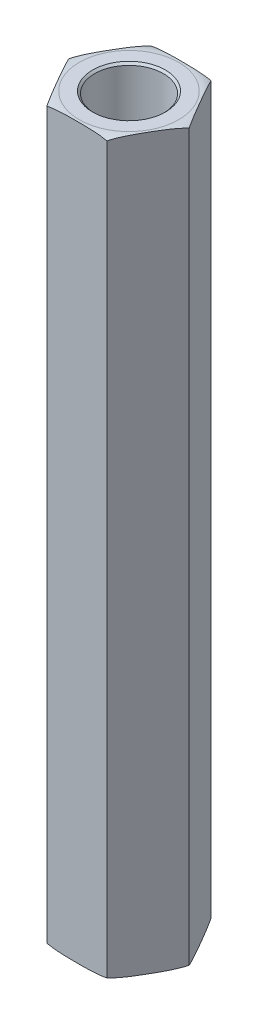
ISO-10303-21;
HEADER;
FILE_DESCRIPTION(('STEP AP214'),'2;1');
FILE_NAME('part.step','',(''),(''),'','','');
FILE_SCHEMA(('AUTOMOTIVE_DESIGN { 1 0 10303 214 1 1 1 1 }'));
ENDSEC;
DATA;
#1=APPLICATION_CONTEXT('core data for automotive mechanical design processes');
#2=APPLICATION_PROTOCOL_DEFINITION('international standard','automotive_design',2000,#1);
#3=PRODUCT_CONTEXT('',#1,'mechanical');
#4=PRODUCT('Part','Part','',(#3));
#5=PRODUCT_RELATED_PRODUCT_CATEGORY('part','',(#4));
#6=PRODUCT_DEFINITION_FORMATION('','',#4);
#7=PRODUCT_DEFINITION_CONTEXT('part definition',#1,'design');
#8=PRODUCT_DEFINITION('design','',#6,#7);
#9=PRODUCT_DEFINITION_SHAPE('','',#8);
#10=(LENGTH_UNIT() NAMED_UNIT(*) SI_UNIT(.MILLI.,.METRE.));
#11=(NAMED_UNIT(*) PLANE_ANGLE_UNIT() SI_UNIT($,.RADIAN.));
#12=(NAMED_UNIT(*) SI_UNIT($,.STERADIAN.) SOLID_ANGLE_UNIT());
#13=UNCERTAINTY_MEASURE_WITH_UNIT(LENGTH_MEASURE(1.E-05),#10,'distance_accuracy_value','');
#14=(GEOMETRIC_REPRESENTATION_CONTEXT(3) GLOBAL_UNCERTAINTY_ASSIGNED_CONTEXT((#13)) GLOBAL_UNIT_ASSIGNED_CONTEXT((#10,
#11,#12)) REPRESENTATION_CONTEXT('',''));
#15=CARTESIAN_POINT('',(0.,0.,0.));
#16=DIRECTION('',(0.,0.,1.));
#17=DIRECTION('',(1.,0.,0.));
#18=AXIS2_PLACEMENT_3D('',#15,#16,#17);
#19=CARTESIAN_POINT('',(0.,9.525,0.));
#20=DIRECTION('',(0.,1.,0.));
#21=DIRECTION('',(0.,0.,1.));
#22=AXIS2_PLACEMENT_3D('',#19,#20,#21);
#23=PLANE('',#22);
#24=CARTESIAN_POINT('',(0.,9.525,0.));
#25=DIRECTION('',(0.,1.,0.));
#26=DIRECTION('',(0.,0.,1.));
#27=AXIS2_PLACEMENT_3D('',#24,#25,#26);
#28=CIRCLE('',#27,2.0955);
#29=CARTESIAN_POINT('',(0.,9.525,2.0955));
#30=VERTEX_POINT('',#29);
#31=EDGE_CURVE('E303',#30,#30,#28,.T.);
#32=ORIENTED_EDGE('',*,*,#31,.T.);
#33=EDGE_LOOP('',(#32));
#34=FACE_BOUND('',#33,.T.);
#35=ADVANCED_FACE('F17',(#34),#23,.T.);
#36=CARTESIAN_POINT('',(0.,-9.525,0.));
#37=DIRECTION('',(0.,-1.,0.));
#38=DIRECTION('',(0.,0.,-1.));
#39=AXIS2_PLACEMENT_3D('',#36,#37,#38);
#40=PLANE('',#39);
#41=CARTESIAN_POINT('',(0.,-9.525,0.));
#42=DIRECTION('',(0.,-1.,0.));
#43=DIRECTION('',(0.,0.,-1.));
#44=AXIS2_PLACEMENT_3D('',#41,#42,#43);
#45=CIRCLE('',#44,2.0955);
#46=CARTESIAN_POINT('',(0.,-9.525,-2.0955));
#47=VERTEX_POINT('',#46);
#48=EDGE_CURVE('E313',#47,#47,#45,.T.);
#49=ORIENTED_EDGE('',*,*,#48,.T.);
#50=EDGE_LOOP('',(#49));
#51=FACE_BOUND('',#50,.T.);
#52=ADVANCED_FACE('F414',(#51),#40,.T.);
#53=CARTESIAN_POINT('',(0.,9.525,0.));
#54=DIRECTION('',(0.,1.,0.));
#55=DIRECTION('',(0.,0.,1.));
#56=AXIS2_PLACEMENT_3D('',#53,#54,#55);
#57=CYLINDRICAL_SURFACE('',#56,2.0955);
#58=CARTESIAN_POINT('',(0.,22.0979999999713,0.));
#59=DIRECTION('',(0.,1.,0.));
#60=DIRECTION('',(0.,0.,1.));
#61=AXIS2_PLACEMENT_3D('',#58,#59,#60);
#62=CIRCLE('',#61,2.09549999993897);
#63=CARTESIAN_POINT('',(0.,22.0979999999713,2.09549999993897));
#64=VERTEX_POINT('',#63);
#65=EDGE_CURVE('E315',#64,#64,#62,.T.);
#66=ORIENTED_EDGE('',*,*,#65,.T.);
#67=EDGE_LOOP('',(#66));
#68=FACE_BOUND('',#67,.T.);
#69=ORIENTED_EDGE('',*,*,#31,.F.);
#70=EDGE_LOOP('',(#69));
#71=FACE_BOUND('',#70,.T.);
#72=ADVANCED_FACE('F325',(#68,#71),#57,.F.);
#73=CARTESIAN_POINT('',(0.,-9.525,0.));
#74=DIRECTION('',(0.,-1.,0.));
#75=DIRECTION('',(0.,0.,-1.));
#76=AXIS2_PLACEMENT_3D('',#73,#74,#75);
#77=CYLINDRICAL_SURFACE('',#76,2.0955);
#78=ORIENTED_EDGE('',*,*,#48,.F.);
#79=EDGE_LOOP('',(#78));
#80=FACE_BOUND('',#79,.T.);
#81=CARTESIAN_POINT('',(0.,-22.0979999999713,0.));
#82=DIRECTION('',(0.,-1.,0.));
#83=DIRECTION('',(0.,0.,-1.));
#84=AXIS2_PLACEMENT_3D('',#81,#82,#83);
#85=CIRCLE('',#84,2.09549999999581);
#86=CARTESIAN_POINT('',(0.,-22.0979999999713,-2.09549999999581));
#87=VERTEX_POINT('',#86);
#88=EDGE_CURVE('E155',#87,#87,#85,.T.);
#89=ORIENTED_EDGE('',*,*,#88,.T.);
#90=EDGE_LOOP('',(#89));
#91=FACE_BOUND('',#90,.T.);
#92=ADVANCED_FACE('F330',(#80,#91),#77,.F.);
#93=CARTESIAN_POINT('',(0.,22.224999999878,0.));
#94=DIRECTION('',(0.,1.,0.));
#95=DIRECTION('',(0.,0.,1.));
#96=AXIS2_PLACEMENT_3D('',#93,#94,#95);
#97=CONICAL_SURFACE('',#96,2.2224999998457,0.785398163397448);
#98=CARTESIAN_POINT('',(0.,22.2249999999917,0.));
#99=DIRECTION('',(0.,1.,0.));
#100=DIRECTION('',(0.,0.,1.));
#101=AXIS2_PLACEMENT_3D('',#98,#99,#100);
#102=CIRCLE('',#101,2.22249999995938);
#103=CARTESIAN_POINT('',(0.,22.2249999999917,2.22249999995938));
#104=VERTEX_POINT('',#103);
#105=EDGE_CURVE('E80',#104,#104,#102,.T.);
#106=ORIENTED_EDGE('',*,*,#105,.T.);
#107=EDGE_LOOP('',(#106));
#108=FACE_BOUND('',#107,.T.);
#109=ORIENTED_EDGE('',*,*,#65,.F.);
#110=EDGE_LOOP('',(#109));
#111=FACE_BOUND('',#110,.T.);
#112=ADVANCED_FACE('F328',(#108,#111),#97,.F.);
#113=CARTESIAN_POINT('',(-3.66617420935413,22.225,0.));
#114=DIRECTION('',(0.866025403784439,0.,-0.499999999999999));
#115=DIRECTION('',(-0.499999999999999,0.,-0.866025403784439));
#116=AXIS2_PLACEMENT_3D('',#113,#114,#115);
#117=PLANE('',#116);
#118=DIRECTION('',(0.,1.,0.));
#119=VECTOR('',#118,1.);
#120=CARTESIAN_POINT('',(-1.83308710467708,22.225,3.175));
#121=LINE('',#120,#119);
#122=CARTESIAN_POINT('',(-1.83308710467708,-22.098,3.17499999999999));
#123=VERTEX_POINT('',#122);
#124=CARTESIAN_POINT('',(-1.83308710467706,22.098,3.175));
#125=VERTEX_POINT('',#124);
#126=EDGE_CURVE('E76',#123,#125,#121,.T.);
#127=ORIENTED_EDGE('',*,*,#126,.T.);
#128=CARTESIAN_POINT('',(-3.66617420935412,22.098,0.));
#129=CARTESIAN_POINT('',(-3.62797961467395,22.1139014148997,0.0661549785605582));
#130=CARTESIAN_POINT('',(-3.58956810864158,22.1274886076105,0.132685658603871));
#131=CARTESIAN_POINT('',(-3.51249051795712,22.1508161979402,0.266187961794345));
#132=CARTESIAN_POINT('',(-3.47382473049848,22.1605604771397,0.333159070187372));
#133=CARTESIAN_POINT('',(-3.39641631867875,22.1769966530451,0.467234372392355));
#134=CARTESIAN_POINT('',(-3.35767399633315,22.1836945328669,0.534338043098154));
#135=CARTESIAN_POINT('',(-3.28009834620116,22.1947767572932,0.668703010556943));
#136=CARTESIAN_POINT('',(-3.24126499587774,22.199160450474,0.735964346345226));
#137=CARTESIAN_POINT('',(-3.16354065964318,22.2062403004263,0.870586845688048));
#138=CARTESIAN_POINT('',(-3.1246496537448,22.2089355237591,0.937948043861515));
#139=CARTESIAN_POINT('',(-3.04685144594597,22.2131531983713,1.07269849250688));
#140=CARTESIAN_POINT('',(-3.00794424351974,22.2146756080272,1.14008774388949));
#141=CARTESIAN_POINT('',(-2.93051517598878,22.216922705889,1.27419882283578));
#142=CARTESIAN_POINT('',(-2.8919933624894,22.2176552468181,1.34092056101641));
#143=CARTESIAN_POINT('',(-2.81494778346149,22.2185767302574,1.4743674183913));
#144=CARTESIAN_POINT('',(-2.77642401791445,22.2187656658949,1.54109253761765));
#145=CARTESIAN_POINT('',(-2.69935964431019,22.2186659966806,1.67457194815371));
#146=CARTESIAN_POINT('',(-2.66081903631828,22.2183771811766,1.74132623935029));
#147=CARTESIAN_POINT('',(-2.58373908085337,22.217221986219,1.87483263846066));
#148=CARTESIAN_POINT('',(-2.54519973341253,22.2163555970386,1.94158474631875));
#149=CARTESIAN_POINT('',(-2.46812969629779,22.2137861940656,2.0750739663427));
#150=CARTESIAN_POINT('',(-2.42959900625973,22.2120832271617,2.1418110791393));
#151=CARTESIAN_POINT('',(-2.35255651340917,22.2074387229726,2.27525259109823));
#152=CARTESIAN_POINT('',(-2.31404470975451,22.2044972471358,2.34195699171921));
#153=CARTESIAN_POINT('',(-2.25084206239953,22.1982174124749,2.4514271881109));
#154=CARTESIAN_POINT('',(-2.22613849337018,22.1953980110463,2.49421502479802));
#155=CARTESIAN_POINT('',(-2.17676945272235,22.1888696794304,2.579724711521));
#156=CARTESIAN_POINT('',(-2.1521039703419,22.1851610809139,2.62244658019713));
#157=CARTESIAN_POINT('',(-2.10282753811702,22.1766802711497,2.70779586442636));
#158=CARTESIAN_POINT('',(-2.07821657107534,22.1719084657009,2.75042330976594));
#159=CARTESIAN_POINT('',(-2.02900094683554,22.1610987712516,2.83566727147549));
#160=CARTESIAN_POINT('',(-2.00439646085467,22.1550577313084,2.87828349128847));
#161=CARTESIAN_POINT('',(-1.95527325900936,22.1415138354161,2.96336737271501));
#162=CARTESIAN_POINT('',(-1.93075459617617,22.134010197803,3.00583494247576));
#163=CARTESIAN_POINT('',(-1.88182157373173,22.1173203507084,3.09058942351743));
#164=CARTESIAN_POINT('',(-1.85740744053271,22.1081314978033,3.13287594264089));
#165=CARTESIAN_POINT('',(-1.83308710467707,22.098,3.175));
#166=B_SPLINE_CURVE_WITH_KNOTS('',3,(#128,#129,#130,#131,#132,#133,#134,#135,#136,#137,#138,
#139,#140,#141,#142,#143,#144,#145,#146,#147,#148,#149,#150,#151,#152,#153,#154,#155,#156,#157,
#158,#159,#160,#161,#162,#163,#164,#165),.UNSPECIFIED.,.F.,.F.,(4,2,2,2,2,2,2,2,2,2,2,2,2,2,2,2,
2,2,4),(0.,0.233977307817926,0.467717675040663,0.700996973557454,0.934341903229689,
1.16781571967232,1.40129782179815,1.63243665809659,1.86357841666605,2.0948221184628,
2.3260697147148,2.55730435147381,2.78852751694395,2.93698369265072,3.08538458004461,
3.23372892334575,3.38244598546606,3.5312427462608,3.68027493713584),.UNSPECIFIED.);
#167=CARTESIAN_POINT('',(-3.66617420935412,22.098,0.));
#168=VERTEX_POINT('',#167);
#169=EDGE_CURVE('E69',#168,#125,#166,.T.);
#170=ORIENTED_EDGE('',*,*,#169,.F.);
#171=DIRECTION('',(0.,1.,0.));
#172=VECTOR('',#171,1.);
#173=CARTESIAN_POINT('',(-3.66617420935413,22.225,0.));
#174=LINE('',#173,#172);
#175=CARTESIAN_POINT('',(-3.66617420935413,-22.098,0.));
#176=VERTEX_POINT('',#175);
#177=EDGE_CURVE('E73',#168,#176,#174,.F.);
#178=ORIENTED_EDGE('',*,*,#177,.T.);
#179=CARTESIAN_POINT('',(-1.83308710467707,-22.098,3.17499999999999));
#180=CARTESIAN_POINT('',(-1.87128169935725,-22.1139014148997,3.10884502143943));
#181=CARTESIAN_POINT('',(-1.90969320538962,-22.1274886076105,3.04231434139612));
#182=CARTESIAN_POINT('',(-1.98677079607408,-22.1508161979402,2.90881203820565));
#183=CARTESIAN_POINT('',(-2.02543658353272,-22.1605604771397,2.84184092981262));
#184=CARTESIAN_POINT('',(-2.10284499535244,-22.1769966530451,2.70776562760764));
#185=CARTESIAN_POINT('',(-2.14158731769805,-22.1836945328669,2.64066195690184));
#186=CARTESIAN_POINT('',(-2.21916296783004,-22.1947767572932,2.50629698944305));
#187=CARTESIAN_POINT('',(-2.25799631815346,-22.199160450474,2.43903565365477));
#188=CARTESIAN_POINT('',(-2.33572065438801,-22.2062403004263,2.30441315431194));
#189=CARTESIAN_POINT('',(-2.3746116602864,-22.2089355237591,2.23705195613848));
#190=CARTESIAN_POINT('',(-2.45240986808523,-22.2131531983713,2.10230150749311));
#191=CARTESIAN_POINT('',(-2.49131707051146,-22.2146756080272,2.03491225611051));
#192=CARTESIAN_POINT('',(-2.56874613804242,-22.216922705889,1.90080117716421));
#193=CARTESIAN_POINT('',(-2.6072679515418,-22.2176552468181,1.83407943898358));
#194=CARTESIAN_POINT('',(-2.6843135305697,-22.2185767302574,1.70063258160869));
#195=CARTESIAN_POINT('',(-2.72283729611675,-22.2187656658949,1.63390746238234));
#196=CARTESIAN_POINT('',(-2.79990166972101,-22.2186659966806,1.50042805184628));
#197=CARTESIAN_POINT('',(-2.83844227771292,-22.2183771811766,1.4336737606497));
#198=CARTESIAN_POINT('',(-2.91552223317783,-22.217221986219,1.30016736153933));
#199=CARTESIAN_POINT('',(-2.95406158061867,-22.2163555970386,1.23341525368124));
#200=CARTESIAN_POINT('',(-3.03113161773341,-22.2137861940656,1.09992603365729));
#201=CARTESIAN_POINT('',(-3.06966230777147,-22.2120832271617,1.03318892086069));
#202=CARTESIAN_POINT('',(-3.14670480062203,-22.2074387229726,0.899747408901759));
#203=CARTESIAN_POINT('',(-3.18521660427668,-22.2044972471358,0.833043008280777));
#204=CARTESIAN_POINT('',(-3.24841925163166,-22.1982174124749,0.72357281188909));
#205=CARTESIAN_POINT('',(-3.27312282066102,-22.1953980110463,0.680784975201967));
#206=CARTESIAN_POINT('',(-3.32249186130885,-22.1888696794304,0.595275288478992));
#207=CARTESIAN_POINT('',(-3.34715734368929,-22.1851610809139,0.552553419802861));
#208=CARTESIAN_POINT('',(-3.39643377591418,-22.1766802711497,0.467204135573637));
#209=CARTESIAN_POINT('',(-3.42104474295585,-22.1719084657009,0.424576690234055));
#210=CARTESIAN_POINT('',(-3.47026036719565,-22.1610987712516,0.339332728524499));
#211=CARTESIAN_POINT('',(-3.49486485317652,-22.1550577313084,0.29671650871152));
#212=CARTESIAN_POINT('',(-3.54398805502183,-22.1415138354161,0.211632627284985));
#213=CARTESIAN_POINT('',(-3.56850671785503,-22.134010197803,0.169165057524237));
#214=CARTESIAN_POINT('',(-3.61743974029946,-22.1173203507084,0.0844105764825624));
#215=CARTESIAN_POINT('',(-3.64185387349848,-22.1081314978033,0.0421240573591061));
#216=CARTESIAN_POINT('',(-3.66617420935413,-22.098,0.));
#217=B_SPLINE_CURVE_WITH_KNOTS('',3,(#179,#180,#181,#182,#183,#184,#185,#186,#187,#188,#189,
#190,#191,#192,#193,#194,#195,#196,#197,#198,#199,#200,#201,#202,#203,#204,#205,#206,#207,#208,
#209,#210,#211,#212,#213,#214,#215,#216),.UNSPECIFIED.,.F.,.F.,(4,2,2,2,2,2,2,2,2,2,2,2,2,2,2,2,
2,2,4),(0.,0.233977307817927,0.467717675040664,0.700996973557455,0.93434190322969,
1.16781571967232,1.40129782179815,1.63243665809659,1.86357841666605,2.09482211846281,
2.3260697147148,2.55730435147381,2.78852751694395,2.93698369265072,3.08538458004461,
3.23372892334575,3.38244598546606,3.5312427462608,3.68027493713584),.UNSPECIFIED.);
#218=EDGE_CURVE('E88',#123,#176,#217,.T.);
#219=ORIENTED_EDGE('',*,*,#218,.F.);
#220=EDGE_LOOP('',(#127,#170,#178,#219));
#221=FACE_BOUND('',#220,.T.);
#222=ADVANCED_FACE('F71',(#221),#117,.F.);
#223=CARTESIAN_POINT('',(0.,-22.2249999998212,0.));
#224=DIRECTION('',(0.,-1.,0.));
#225=DIRECTION('',(0.,0.,-1.));
#226=AXIS2_PLACEMENT_3D('',#223,#224,#225);
#227=CONICAL_SURFACE('',#226,2.2224999998457,0.785398163397448);
#228=ORIENTED_EDGE('',*,*,#88,.F.);
#229=EDGE_LOOP('',(#228));
#230=FACE_BOUND('',#229,.T.);
#231=CARTESIAN_POINT('',(0.,-22.2249999999349,0.));
#232=DIRECTION('',(0.,-1.,0.));
#233=DIRECTION('',(0.,0.,-1.));
#234=AXIS2_PLACEMENT_3D('',#231,#232,#233);
#235=CIRCLE('',#234,2.22249999995938);
#236=CARTESIAN_POINT('',(0.,-22.2249999999349,-2.22249999995938));
#237=VERTEX_POINT('',#236);
#238=EDGE_CURVE('E279',#237,#237,#235,.F.);
#239=ORIENTED_EDGE('',*,*,#238,.F.);
#240=EDGE_LOOP('',(#239));
#241=FACE_BOUND('',#240,.T.);
#242=ADVANCED_FACE('F337',(#230,#241),#227,.F.);
#243=CARTESIAN_POINT('',(-1.83308710467707,22.225,-3.175));
#244=DIRECTION('',(0.,-1.,0.));
#245=DIRECTION('',(0.,0.,-1.));
#246=AXIS2_PLACEMENT_3D('',#243,#244,#245);
#247=PLANE('',#246);
#248=CARTESIAN_POINT('',(0.,22.225,0.));
#249=DIRECTION('',(0.,-1.,0.));
#250=DIRECTION('',(0.,0.,1.));
#251=AXIS2_PLACEMENT_3D('',#248,#249,#250);
#252=CIRCLE('',#251,3.03117420935412);
#253=CARTESIAN_POINT('',(0.,22.225,3.03117420935412));
#254=VERTEX_POINT('',#253);
#255=CARTESIAN_POINT('',(0.,22.225,-3.03117420935412));
#256=VERTEX_POINT('',#255);
#257=EDGE_CURVE('E79',#254,#256,#252,.T.);
#258=ORIENTED_EDGE('',*,*,#257,.F.);
#259=CARTESIAN_POINT('',(0.,22.225,0.));
#260=DIRECTION('',(0.,-1.,0.));
#261=DIRECTION('',(0.,0.,-1.));
#262=AXIS2_PLACEMENT_3D('',#259,#260,#261);
#263=CIRCLE('',#262,3.03117420935412);
#264=EDGE_CURVE('E140',#256,#254,#263,.T.);
#265=ORIENTED_EDGE('',*,*,#264,.F.);
#266=EDGE_LOOP('',(#258,#265));
#267=FACE_BOUND('',#266,.T.);
#268=ORIENTED_EDGE('',*,*,#105,.F.);
#269=EDGE_LOOP('',(#268));
#270=FACE_BOUND('',#269,.T.);
#271=ADVANCED_FACE('F116',(#267,#270),#247,.F.);
#272=CARTESIAN_POINT('',(-1.83308710467707,22.225,-3.175));
#273=DIRECTION('',(0.866025403784439,0.,0.5));
#274=DIRECTION('',(0.5,0.,-0.866025403784439));
#275=AXIS2_PLACEMENT_3D('',#272,#273,#274);
#276=PLANE('',#275);
#277=ORIENTED_EDGE('',*,*,#177,.F.);
#278=CARTESIAN_POINT('',(-1.83308710467706,22.098,-3.17500000000001));
#279=CARTESIAN_POINT('',(-1.87128169935723,22.1139014148997,-3.10884502143946));
#280=CARTESIAN_POINT('',(-1.9096932053896,22.1274886076105,-3.04231434139615));
#281=CARTESIAN_POINT('',(-1.98677079607406,22.1508161979402,-2.90881203820568));
#282=CARTESIAN_POINT('',(-2.0254365835327,22.1605604771397,-2.84184092981265));
#283=CARTESIAN_POINT('',(-2.10284499535242,22.1769966530451,-2.70776562760768));
#284=CARTESIAN_POINT('',(-2.14158731769803,22.1836945328669,-2.64066195690188));
#285=CARTESIAN_POINT('',(-2.21916296783001,22.1947767572932,-2.50629698944309));
#286=CARTESIAN_POINT('',(-2.25799631815343,22.199160450474,-2.43903565365481));
#287=CARTESIAN_POINT('',(-2.33572065438798,22.2062403004263,-2.304413154312));
#288=CARTESIAN_POINT('',(-2.37461166028637,22.2089355237591,-2.23705195613853));
#289=CARTESIAN_POINT('',(-2.45240986808519,22.2131531983713,-2.10230150749317));
#290=CARTESIAN_POINT('',(-2.49131707051143,22.2146756080272,-2.03491225611057));
#291=CARTESIAN_POINT('',(-2.56874613804238,22.216922705889,-1.90080117716427));
#292=CARTESIAN_POINT('',(-2.60726795154176,22.2176552468181,-1.83407943898365));
#293=CARTESIAN_POINT('',(-2.68431353056967,22.2185767302574,-1.70063258160876));
#294=CARTESIAN_POINT('',(-2.72283729611671,22.2187656658949,-1.63390746238241));
#295=CARTESIAN_POINT('',(-2.79990166972097,22.2186659966806,-1.50042805184636));
#296=CARTESIAN_POINT('',(-2.83844227771287,22.2183771811766,-1.43367376064978));
#297=CARTESIAN_POINT('',(-2.91552223317778,22.217221986219,-1.30016736153941));
#298=CARTESIAN_POINT('',(-2.95406158061863,22.2163555970386,-1.23341525368133));
#299=CARTESIAN_POINT('',(-3.03113161773336,22.2137861940656,-1.09992603365738));
#300=CARTESIAN_POINT('',(-3.06966230777142,22.2120832271617,-1.03318892086078));
#301=CARTESIAN_POINT('',(-3.14670480062198,22.2074387229726,-0.899747408901853));
#302=CARTESIAN_POINT('',(-3.18521660427663,22.2044972471358,-0.833043008280874));
#303=CARTESIAN_POINT('',(-3.24841925163161,22.1982174124749,-0.723572811889183));
#304=CARTESIAN_POINT('',(-3.27312282066097,22.1953980110463,-0.680784975202055));
#305=CARTESIAN_POINT('',(-3.32249186130881,22.1888696794304,-0.59527528847907));
#306=CARTESIAN_POINT('',(-3.34715734368926,22.1851610809139,-0.552553419802933));
#307=CARTESIAN_POINT('',(-3.39643377591415,22.1766802711497,-0.467204135573699));
#308=CARTESIAN_POINT('',(-3.42104474295582,22.1719084657009,-0.424576690234111));
#309=CARTESIAN_POINT('',(-3.47026036719563,22.1610987712516,-0.339332728524545));
#310=CARTESIAN_POINT('',(-3.4948648531765,22.1550577313084,-0.296716508711562));
#311=CARTESIAN_POINT('',(-3.54398805502182,22.1415138354161,-0.211632627285016));
#312=CARTESIAN_POINT('',(-3.56850671785502,22.134010197803,-0.169165057524262));
#313=CARTESIAN_POINT('',(-3.61743974029946,22.1173203507084,-0.0844105764825773));
#314=CARTESIAN_POINT('',(-3.64185387349848,22.1081314978033,-0.0421240573591156));
#315=CARTESIAN_POINT('',(-3.66617420935413,22.098,0.));
#316=B_SPLINE_CURVE_WITH_KNOTS('',3,(#278,#279,#280,#281,#282,#283,#284,#285,#286,#287,#288,
#289,#290,#291,#292,#293,#294,#295,#296,#297,#298,#299,#300,#301,#302,#303,#304,#305,#306,#307,
#308,#309,#310,#311,#312,#313,#314,#315),.UNSPECIFIED.,.F.,.F.,(4,2,2,2,2,2,2,2,2,2,2,2,2,2,2,2,
2,2,4),(0.,0.23397730781792,0.46771767504065,0.700996973557434,0.934341903229661,
1.16781571967229,1.40129782179811,1.63243665809654,1.86357841666599,2.09482211846274,
2.32606971471473,2.55730435147373,2.78852751694387,2.93698369265066,3.08538458004457,
3.23372892334572,3.38244598546605,3.53124274626081,3.68027493713586),.UNSPECIFIED.);
#317=CARTESIAN_POINT('',(-1.83308710467705,22.098,-3.17500000000001));
#318=VERTEX_POINT('',#317);
#319=EDGE_CURVE('E85',#318,#168,#316,.T.);
#320=ORIENTED_EDGE('',*,*,#319,.F.);
#321=DIRECTION('',(0.,1.,0.));
#322=VECTOR('',#321,1.);
#323=CARTESIAN_POINT('',(-1.83308710467704,22.225,-3.175));
#324=LINE('',#323,#322);
#325=CARTESIAN_POINT('',(-1.83308710467707,-22.098,-3.175));
#326=VERTEX_POINT('',#325);
#327=EDGE_CURVE('E178',#318,#326,#324,.F.);
#328=ORIENTED_EDGE('',*,*,#327,.T.);
#329=CARTESIAN_POINT('',(-3.66617420935413,-22.098,0.));
#330=CARTESIAN_POINT('',(-3.62797961467396,-22.1139014148997,-0.0661549785605599));
#331=CARTESIAN_POINT('',(-3.58956810864158,-22.1274886076105,-0.132685658603872));
#332=CARTESIAN_POINT('',(-3.51249051795713,-22.1508161979402,-0.266187961794346));
#333=CARTESIAN_POINT('',(-3.47382473049848,-22.1605604771397,-0.333159070187373));
#334=CARTESIAN_POINT('',(-3.39641631867876,-22.1769966530451,-0.467234372392355));
#335=CARTESIAN_POINT('',(-3.35767399633315,-22.1836945328669,-0.534338043098153));
#336=CARTESIAN_POINT('',(-3.28009834620117,-22.1947767572932,-0.668703010556941));
#337=CARTESIAN_POINT('',(-3.24126499587775,-22.199160450474,-0.735964346345223));
#338=CARTESIAN_POINT('',(-3.16354065964319,-22.2062403004263,-0.870586845688044));
#339=CARTESIAN_POINT('',(-3.1246496537448,-22.2089355237591,-0.93794804386151));
#340=CARTESIAN_POINT('',(-3.04685144594598,-22.2131531983713,-1.07269849250688));
#341=CARTESIAN_POINT('',(-3.00794424351974,-22.2146756080272,-1.14008774388948));
#342=CARTESIAN_POINT('',(-2.93051517598879,-22.216922705889,-1.27419882283578));
#343=CARTESIAN_POINT('',(-2.8919933624894,-22.2176552468181,-1.3409205610164));
#344=CARTESIAN_POINT('',(-2.8149477834615,-22.2185767302574,-1.4743674183913));
#345=CARTESIAN_POINT('',(-2.77642401791446,-22.2187656658949,-1.54109253761764));
#346=CARTESIAN_POINT('',(-2.6993596443102,-22.2186659966806,-1.6745719481537));
#347=CARTESIAN_POINT('',(-2.66081903631829,-22.2183771811766,-1.74132623935028));
#348=CARTESIAN_POINT('',(-2.58373908085338,-22.217221986219,-1.87483263846065));
#349=CARTESIAN_POINT('',(-2.54519973341253,-22.2163555970386,-1.94158474631874));
#350=CARTESIAN_POINT('',(-2.46812969629779,-22.2137861940656,-2.07507396634269));
#351=CARTESIAN_POINT('',(-2.42959900625974,-22.2120832271617,-2.14181107913928));
#352=CARTESIAN_POINT('',(-2.35255651340918,-22.2074387229726,-2.27525259109822));
#353=CARTESIAN_POINT('',(-2.31404470975453,-22.2044972471358,-2.3419569917192));
#354=CARTESIAN_POINT('',(-2.25084206239954,-22.1982174124749,-2.45142718811089));
#355=CARTESIAN_POINT('',(-2.22613849337019,-22.1953980110463,-2.49421502479801));
#356=CARTESIAN_POINT('',(-2.17676945272236,-22.1888696794304,-2.57972471152099));
#357=CARTESIAN_POINT('',(-2.15210397034191,-22.1851610809139,-2.62244658019712));
#358=CARTESIAN_POINT('',(-2.10282753811703,-22.1766802711497,-2.70779586442634));
#359=CARTESIAN_POINT('',(-2.07821657107535,-22.1719084657009,-2.75042330976593));
#360=CARTESIAN_POINT('',(-2.02900094683555,-22.1610987712516,-2.83566727147548));
#361=CARTESIAN_POINT('',(-2.00439646085468,-22.1550577313084,-2.87828349128846));
#362=CARTESIAN_POINT('',(-1.95527325900937,-22.1415138354161,-2.963367372715));
#363=CARTESIAN_POINT('',(-1.93075459617617,-22.134010197803,-3.00583494247575));
#364=CARTESIAN_POINT('',(-1.88182157373174,-22.1173203507084,-3.09058942351742));
#365=CARTESIAN_POINT('',(-1.85740744053272,-22.1081314978033,-3.13287594264088));
#366=CARTESIAN_POINT('',(-1.83308710467707,-22.098,-3.17499999999999));
#367=B_SPLINE_CURVE_WITH_KNOTS('',3,(#329,#330,#331,#332,#333,#334,#335,#336,#337,#338,#339,
#340,#341,#342,#343,#344,#345,#346,#347,#348,#349,#350,#351,#352,#353,#354,#355,#356,#357,#358,
#359,#360,#361,#362,#363,#364,#365,#366),.UNSPECIFIED.,.F.,.F.,(4,2,2,2,2,2,2,2,2,2,2,2,2,2,2,2,
2,2,4),(0.,0.233977307817925,0.467717675040661,0.70099697355745,0.934341903229683,
1.16781571967231,1.40129782179814,1.63243665809658,1.86357841666603,2.09482211846279,
2.32606971471478,2.55730435147379,2.78852751694393,2.9369836926507,3.0853845800446,
3.23372892334574,3.38244598546605,3.53124274626079,3.68027493713583),.UNSPECIFIED.);
#368=EDGE_CURVE('E87',#176,#326,#367,.T.);
#369=ORIENTED_EDGE('',*,*,#368,.F.);
#370=EDGE_LOOP('',(#277,#320,#328,#369));
#371=FACE_BOUND('',#370,.T.);
#372=ADVANCED_FACE('F83',(#371),#276,.F.);
#373=CARTESIAN_POINT('',(-1.83308710467707,22.225,3.175));
#374=DIRECTION('',(0.,0.,-1.));
#375=DIRECTION('',(-1.,0.,0.));
#376=AXIS2_PLACEMENT_3D('',#373,#374,#375);
#377=PLANE('',#376);
#378=DIRECTION('',(0.,1.,0.));
#379=VECTOR('',#378,1.);
#380=CARTESIAN_POINT('',(1.83308710467706,22.225,3.17499999999999));
#381=LINE('',#380,#379);
#382=CARTESIAN_POINT('',(1.83308710467706,-22.098,3.17499999999999));
#383=VERTEX_POINT('',#382);
#384=CARTESIAN_POINT('',(1.83308710467706,22.098,3.17499999999999));
#385=VERTEX_POINT('',#384);
#386=EDGE_CURVE('E180',#383,#385,#381,.T.);
#387=ORIENTED_EDGE('',*,*,#386,.T.);
#388=CARTESIAN_POINT('',(-1.83308710467706,22.098,3.175));
#389=CARTESIAN_POINT('',(-1.73237579828683,22.1189400141518,3.175));
#390=CARTESIAN_POINT('',(-1.63096506893486,22.1358853495327,3.175));
#391=CARTESIAN_POINT('',(-1.42767146651469,22.1634971643984,3.175));
#392=CARTESIAN_POINT('',(-1.32579191427254,22.1741875658753,3.175));
#393=CARTESIAN_POINT('',(-1.12177634709138,22.1911280408079,3.175));
#394=CARTESIAN_POINT('',(-1.0196405664338,22.1973812707189,3.175));
#395=CARTESIAN_POINT('',(-0.815663681397377,22.2069028064183,3.175));
#396=CARTESIAN_POINT('',(-0.713823115514574,22.2101834044999,3.175));
#397=CARTESIAN_POINT('',(-0.510018485441652,22.2149454848703,3.175));
#398=CARTESIAN_POINT('',(-0.408054390577977,22.2164254100882,3.175));
#399=CARTESIAN_POINT('',(-0.204060200337871,22.2183146818379,3.175));
#400=CARTESIAN_POINT('',(-0.102030100168935,22.2187234241492,3.175));
#401=CARTESIAN_POINT('',(0.102030100168935,22.2187234241492,3.175));
#402=CARTESIAN_POINT('',(0.204060200337871,22.2183146818379,3.175));
#403=CARTESIAN_POINT('',(0.408054390577978,22.2164254100882,3.17499999999999));
#404=CARTESIAN_POINT('',(0.510018485441653,22.2149454848703,3.17499999999999));
#405=CARTESIAN_POINT('',(0.713823115514575,22.2101834044999,3.17499999999999));
#406=CARTESIAN_POINT('',(0.815663681397378,22.2069028064183,3.17499999999999));
#407=CARTESIAN_POINT('',(1.0196405664338,22.1973812707189,3.17499999999999));
#408=CARTESIAN_POINT('',(1.12177634709138,22.1911280408079,3.17499999999999));
#409=CARTESIAN_POINT('',(1.32579191427254,22.1741875658753,3.17499999999999));
#410=CARTESIAN_POINT('',(1.42767146651469,22.1634971643984,3.17499999999999));
#411=CARTESIAN_POINT('',(1.63096506893486,22.1358853495327,3.17499999999999));
#412=CARTESIAN_POINT('',(1.73237579828684,22.1189400141518,3.17499999999999));
#413=CARTESIAN_POINT('',(1.83308710467706,22.098,3.17499999999999));
#414=B_SPLINE_CURVE_WITH_KNOTS('',3,(#388,#389,#390,#391,#392,#393,#394,#395,#396,#397,#398,
#399,#400,#401,#402,#403,#404,#405,#406,#407,#408,#409,#410,#411,#412,#413),.UNSPECIFIED.,.F.,
.F.,(4,2,2,2,2,2,2,2,2,2,2,2,4),(0.,0.308333242342808,0.615479423308236,0.92240689113001,
1.2280592962085,1.53397581645216,1.84006485747889,2.14615389850562,2.45207041874928,
2.75772282382777,3.06465029164955,3.37179647261497,3.68012971495778),.UNSPECIFIED.);
#415=EDGE_CURVE('E274',#125,#385,#414,.T.);
#416=ORIENTED_EDGE('',*,*,#415,.F.);
#417=ORIENTED_EDGE('',*,*,#126,.F.);
#418=CARTESIAN_POINT('',(1.83308710467706,-22.098,3.17499999999999));
#419=CARTESIAN_POINT('',(1.73237579828684,-22.1189400141518,3.17499999999999));
#420=CARTESIAN_POINT('',(1.63096506893486,-22.1358853495327,3.17499999999999));
#421=CARTESIAN_POINT('',(1.4276714665147,-22.1634971643984,3.17499999999999));
#422=CARTESIAN_POINT('',(1.32579191427254,-22.1741875658753,3.17499999999999));
#423=CARTESIAN_POINT('',(1.12177634709138,-22.1911280408079,3.17499999999999));
#424=CARTESIAN_POINT('',(1.0196405664338,-22.1973812707189,3.17499999999999));
#425=CARTESIAN_POINT('',(0.815663681397379,-22.2069028064183,3.17499999999999));
#426=CARTESIAN_POINT('',(0.713823115514576,-22.2101834044999,3.17499999999999));
#427=CARTESIAN_POINT('',(0.510018485441653,-22.2149454848703,3.17499999999999));
#428=CARTESIAN_POINT('',(0.408054390577978,-22.2164254100882,3.17499999999999));
#429=CARTESIAN_POINT('',(0.204060200337871,-22.2183146818379,3.175));
#430=CARTESIAN_POINT('',(0.102030100168936,-22.2187234241492,3.175));
#431=CARTESIAN_POINT('',(-0.102030100168936,-22.2187234241492,3.175));
#432=CARTESIAN_POINT('',(-0.204060200337872,-22.2183146818379,3.175));
#433=CARTESIAN_POINT('',(-0.408054390577981,-22.2164254100882,3.175));
#434=CARTESIAN_POINT('',(-0.510018485441656,-22.2149454848703,3.175));
#435=CARTESIAN_POINT('',(-0.71382311551458,-22.2101834044999,3.175));
#436=CARTESIAN_POINT('',(-0.815663681397384,-22.2069028064183,3.175));
#437=CARTESIAN_POINT('',(-1.01964056643381,-22.1973812707189,3.175));
#438=CARTESIAN_POINT('',(-1.12177634709139,-22.1911280408079,3.175));
#439=CARTESIAN_POINT('',(-1.32579191427255,-22.1741875658753,3.175));
#440=CARTESIAN_POINT('',(-1.4276714665147,-22.1634971643984,3.175));
#441=CARTESIAN_POINT('',(-1.63096506893487,-22.1358853495327,3.175));
#442=CARTESIAN_POINT('',(-1.73237579828685,-22.1189400141518,3.175));
#443=CARTESIAN_POINT('',(-1.83308710467708,-22.098,3.175));
#444=B_SPLINE_CURVE_WITH_KNOTS('',3,(#418,#419,#420,#421,#422,#423,#424,#425,#426,#427,#428,
#429,#430,#431,#432,#433,#434,#435,#436,#437,#438,#439,#440,#441,#442,#443),.UNSPECIFIED.,.F.,
.F.,(4,2,2,2,2,2,2,2,2,2,2,2,4),(0.,0.308333242342808,0.615479423308238,0.922406891130012,
1.22805929620851,1.53397581645217,1.84006485747889,2.14615389850563,2.45207041874929,
2.75772282382778,3.06465029164956,3.37179647261499,3.6801297149578),.UNSPECIFIED.);
#445=EDGE_CURVE('E251',#383,#123,#444,.T.);
#446=ORIENTED_EDGE('',*,*,#445,.F.);
#447=EDGE_LOOP('',(#387,#416,#417,#446));
#448=FACE_BOUND('',#447,.T.);
#449=ADVANCED_FACE('F204',(#448),#377,.F.);
#450=CARTESIAN_POINT('',(-1.83308710467707,-22.225,-3.175));
#451=DIRECTION('',(0.,-1.,0.));
#452=DIRECTION('',(0.,0.,-1.));
#453=AXIS2_PLACEMENT_3D('',#450,#451,#452);
#454=PLANE('',#453);
#455=CARTESIAN_POINT('',(0.,-22.225,0.));
#456=DIRECTION('',(0.,1.,0.));
#457=DIRECTION('',(0.,0.,1.));
#458=AXIS2_PLACEMENT_3D('',#455,#456,#457);
#459=CIRCLE('',#458,3.03117420935413);
#460=CARTESIAN_POINT('',(0.,-22.225,3.03117420935412));
#461=VERTEX_POINT('',#460);
#462=CARTESIAN_POINT('',(0.,-22.225,-3.03117420935412));
#463=VERTEX_POINT('',#462);
#464=EDGE_CURVE('E190',#461,#463,#459,.T.);
#465=ORIENTED_EDGE('',*,*,#464,.F.);
#466=CARTESIAN_POINT('',(0.,-22.225,0.));
#467=DIRECTION('',(0.,1.,0.));
#468=DIRECTION('',(0.,0.,-1.));
#469=AXIS2_PLACEMENT_3D('',#466,#467,#468);
#470=CIRCLE('',#469,3.03117420935413);
#471=EDGE_CURVE('E183',#461,#463,#470,.F.);
#472=ORIENTED_EDGE('',*,*,#471,.T.);
#473=EDGE_LOOP('',(#465,#472));
#474=FACE_BOUND('',#473,.T.);
#475=ORIENTED_EDGE('',*,*,#238,.T.);
#476=EDGE_LOOP('',(#475));
#477=FACE_BOUND('',#476,.T.);
#478=ADVANCED_FACE('F195',(#474,#477),#454,.T.);
#479=CARTESIAN_POINT('',(1.83308710467706,22.225,3.17499999999999));
#480=DIRECTION('',(-0.866025403784439,0.,-0.5));
#481=DIRECTION('',(-0.5,0.,0.866025403784439));
#482=AXIS2_PLACEMENT_3D('',#479,#480,#481);
#483=PLANE('',#482);
#484=DIRECTION('',(0.,1.,0.));
#485=VECTOR('',#484,1.);
#486=CARTESIAN_POINT('',(3.66617420935412,22.225,0.));
#487=LINE('',#486,#485);
#488=CARTESIAN_POINT('',(3.66617420935412,-22.098,0.));
#489=VERTEX_POINT('',#488);
#490=CARTESIAN_POINT('',(3.66617420935412,22.098,0.));
#491=VERTEX_POINT('',#490);
#492=EDGE_CURVE('E236',#489,#491,#487,.T.);
#493=ORIENTED_EDGE('',*,*,#492,.T.);
#494=CARTESIAN_POINT('',(1.83308710467706,22.098,3.17499999999999));
#495=CARTESIAN_POINT('',(1.87128169935723,22.1139014148997,3.10884502143944));
#496=CARTESIAN_POINT('',(1.90969320538961,22.1274886076105,3.04231434139613));
#497=CARTESIAN_POINT('',(1.98677079607406,22.1508161979402,2.90881203820565));
#498=CARTESIAN_POINT('',(2.02543658353271,22.1605604771397,2.84184092981263));
#499=CARTESIAN_POINT('',(2.10284499535243,22.1769966530451,2.70776562760764));
#500=CARTESIAN_POINT('',(2.14158731769804,22.1836945328669,2.64066195690184));
#501=CARTESIAN_POINT('',(2.21916296783002,22.1947767572932,2.50629698944305));
#502=CARTESIAN_POINT('',(2.25799631815344,22.199160450474,2.43903565365477));
#503=CARTESIAN_POINT('',(2.335720654388,22.2062403004263,2.30441315431195));
#504=CARTESIAN_POINT('',(2.37461166028639,22.2089355237591,2.23705195613848));
#505=CARTESIAN_POINT('',(2.45240986808522,22.2131531983713,2.10230150749311));
#506=CARTESIAN_POINT('',(2.49131707051145,22.2146756080272,2.03491225611051));
#507=CARTESIAN_POINT('',(2.56874613804241,22.216922705889,1.90080117716421));
#508=CARTESIAN_POINT('',(2.60726795154179,22.2176552468181,1.83407943898358));
#509=CARTESIAN_POINT('',(2.68431353056969,22.2185767302574,1.70063258160869));
#510=CARTESIAN_POINT('',(2.72283729611674,22.2187656658949,1.63390746238234));
#511=CARTESIAN_POINT('',(2.799901669721,22.2186659966806,1.50042805184629));
#512=CARTESIAN_POINT('',(2.83844227771291,22.2183771811766,1.43367376064971));
#513=CARTESIAN_POINT('',(2.91552223317782,22.217221986219,1.30016736153934));
#514=CARTESIAN_POINT('',(2.95406158061866,22.2163555970386,1.23341525368125));
#515=CARTESIAN_POINT('',(3.0311316177334,22.2137861940656,1.0999260336573));
#516=CARTESIAN_POINT('',(3.06966230777146,22.2120832271617,1.0331889208607));
#517=CARTESIAN_POINT('',(3.14670480062202,22.2074387229726,0.899747408901764));
#518=CARTESIAN_POINT('',(3.18521660427667,22.2044972471358,0.833043008280782));
#519=CARTESIAN_POINT('',(3.24841925163165,22.1982174124749,0.723572811889095));
#520=CARTESIAN_POINT('',(3.27312282066101,22.1953980110463,0.680784975201973));
#521=CARTESIAN_POINT('',(3.32249186130884,22.1888696794304,0.595275288478998));
#522=CARTESIAN_POINT('',(3.34715734368929,22.1851610809139,0.552553419802867));
#523=CARTESIAN_POINT('',(3.39643377591417,22.1766802711497,0.467204135573642));
#524=CARTESIAN_POINT('',(3.42104474295584,22.1719084657009,0.42457669023406));
#525=CARTESIAN_POINT('',(3.47026036719565,22.1610987712516,0.339332728524504));
#526=CARTESIAN_POINT('',(3.49486485317651,22.1550577313084,0.296716508711526));
#527=CARTESIAN_POINT('',(3.54398805502182,22.1415138354161,0.211632627284991));
#528=CARTESIAN_POINT('',(3.56850671785502,22.134010197803,0.169165057524242));
#529=CARTESIAN_POINT('',(3.61743974029946,22.1173203507084,0.0844105764825674));
#530=CARTESIAN_POINT('',(3.64185387349848,22.1081314978033,0.042124057359111));
#531=CARTESIAN_POINT('',(3.66617420935412,22.098,0.));
#532=B_SPLINE_CURVE_WITH_KNOTS('',3,(#494,#495,#496,#497,#498,#499,#500,#501,#502,#503,#504,
#505,#506,#507,#508,#509,#510,#511,#512,#513,#514,#515,#516,#517,#518,#519,#520,#521,#522,#523,
#524,#525,#526,#527,#528,#529,#530,#531),.UNSPECIFIED.,.F.,.F.,(4,2,2,2,2,2,2,2,2,2,2,2,2,2,2,2,
2,2,4),(0.,0.233977307817926,0.467717675040663,0.700996973557454,0.93434190322969,
1.16781571967232,1.40129782179816,1.63243665809659,1.86357841666605,2.09482211846281,
2.3260697147148,2.55730435147381,2.78852751694395,2.93698369265072,3.08538458004461,
3.23372892334575,3.38244598546606,3.5312427462608,3.68027493713584),.UNSPECIFIED.);
#533=EDGE_CURVE('E269',#385,#491,#532,.T.);
#534=ORIENTED_EDGE('',*,*,#533,.F.);
#535=ORIENTED_EDGE('',*,*,#386,.F.);
#536=CARTESIAN_POINT('',(3.66617420935412,-22.098,0.));
#537=CARTESIAN_POINT('',(3.62797961467395,-22.1139014148997,0.0661549785605582));
#538=CARTESIAN_POINT('',(3.58956810864157,-22.1274886076105,0.132685658603871));
#539=CARTESIAN_POINT('',(3.51249051795712,-22.1508161979402,0.266187961794347));
#540=CARTESIAN_POINT('',(3.47382473049847,-22.1605604771397,0.333159070187374));
#541=CARTESIAN_POINT('',(3.39641631867875,-22.1769966530451,0.467234372392357));
#542=CARTESIAN_POINT('',(3.35767399633314,-22.1836945328669,0.534338043098157));
#543=CARTESIAN_POINT('',(3.28009834620115,-22.1947767572932,0.668703010556946));
#544=CARTESIAN_POINT('',(3.24126499587773,-22.199160450474,0.73596434634523));
#545=CARTESIAN_POINT('',(3.16354065964318,-22.2062403004263,0.870586845688052));
#546=CARTESIAN_POINT('',(3.12464965374479,-22.2089355237591,0.937948043861519));
#547=CARTESIAN_POINT('',(3.04685144594596,-22.2131531983713,1.07269849250689));
#548=CARTESIAN_POINT('',(3.00794424351973,-22.2146756080272,1.14008774388949));
#549=CARTESIAN_POINT('',(2.93051517598877,-22.216922705889,1.27419882283579));
#550=CARTESIAN_POINT('',(2.89199336248939,-22.2176552468181,1.34092056101642));
#551=CARTESIAN_POINT('',(2.81494778346148,-22.2185767302574,1.47436741839131));
#552=CARTESIAN_POINT('',(2.77642401791444,-22.2187656658949,1.54109253761766));
#553=CARTESIAN_POINT('',(2.69935964431018,-22.2186659966806,1.67457194815371));
#554=CARTESIAN_POINT('',(2.66081903631827,-22.2183771811766,1.74132623935029));
#555=CARTESIAN_POINT('',(2.58373908085336,-22.217221986219,1.87483263846067));
#556=CARTESIAN_POINT('',(2.54519973341251,-22.2163555970386,1.94158474631876));
#557=CARTESIAN_POINT('',(2.46812969629777,-22.2137861940656,2.07507396634271));
#558=CARTESIAN_POINT('',(2.42959900625972,-22.2120832271617,2.14181107913931));
#559=CARTESIAN_POINT('',(2.35255651340916,-22.2074387229726,2.27525259109824));
#560=CARTESIAN_POINT('',(2.3140447097545,-22.2044972471358,2.34195699171922));
#561=CARTESIAN_POINT('',(2.25084206239952,-22.1982174124749,2.45142718811091));
#562=CARTESIAN_POINT('',(2.22613849337017,-22.1953980110463,2.49421502479803));
#563=CARTESIAN_POINT('',(2.17676945272234,-22.1888696794304,2.57972471152101));
#564=CARTESIAN_POINT('',(2.15210397034189,-22.1851610809139,2.62244658019714));
#565=CARTESIAN_POINT('',(2.10282753811701,-22.1766802711497,2.70779586442636));
#566=CARTESIAN_POINT('',(2.07821657107533,-22.1719084657009,2.75042330976594));
#567=CARTESIAN_POINT('',(2.02900094683553,-22.1610987712516,2.8356672714755));
#568=CARTESIAN_POINT('',(2.00439646085466,-22.1550577313084,2.87828349128847));
#569=CARTESIAN_POINT('',(1.95527325900936,-22.1415138354161,2.96336737271501));
#570=CARTESIAN_POINT('',(1.93075459617616,-22.134010197803,3.00583494247576));
#571=CARTESIAN_POINT('',(1.88182157373172,-22.1173203507084,3.09058942351743));
#572=CARTESIAN_POINT('',(1.8574074405327,-22.1081314978033,3.13287594264088));
#573=CARTESIAN_POINT('',(1.83308710467706,-22.098,3.17499999999999));
#574=B_SPLINE_CURVE_WITH_KNOTS('',3,(#536,#537,#538,#539,#540,#541,#542,#543,#544,#545,#546,
#547,#548,#549,#550,#551,#552,#553,#554,#555,#556,#557,#558,#559,#560,#561,#562,#563,#564,#565,
#566,#567,#568,#569,#570,#571,#572,#573),.UNSPECIFIED.,.F.,.F.,(4,2,2,2,2,2,2,2,2,2,2,2,2,2,2,2,
2,2,4),(0.,0.233977307817928,0.467717675040666,0.700996973557458,0.934341903229694,
1.16781571967233,1.40129782179816,1.6324366580966,1.86357841666606,2.09482211846282,
2.32606971471481,2.55730435147382,2.78852751694396,2.93698369265073,3.08538458004462,
3.23372892334576,3.38244598546606,3.5312427462608,3.68027493713584),.UNSPECIFIED.);
#575=EDGE_CURVE('E256',#489,#383,#574,.T.);
#576=ORIENTED_EDGE('',*,*,#575,.F.);
#577=EDGE_LOOP('',(#493,#534,#535,#576));
#578=FACE_BOUND('',#577,.T.);
#579=ADVANCED_FACE('F168',(#578),#483,.F.);
#580=CARTESIAN_POINT('',(0.,20.5740000000001,0.));
#581=DIRECTION('',(0.,1.,0.));
#582=DIRECTION('',(0.,0.,1.));
#583=AXIS2_PLACEMENT_3D('',#580,#581,#582);
#584=TOROIDAL_SURFACE('',#583,3.03117420935414,1.65099999999989);
#585=ORIENTED_EDGE('',*,*,#257,.T.);
#586=ORIENTED_EDGE('',*,*,#264,.T.);
#587=EDGE_LOOP('',(#585,#586));
#588=FACE_BOUND('',#587,.T.);
#589=ORIENTED_EDGE('',*,*,#533,.T.);
#590=CARTESIAN_POINT('',(3.66617420935412,22.098,0.));
#591=CARTESIAN_POINT('',(3.62797961467395,22.1139014148997,-0.0661549785605537));
#592=CARTESIAN_POINT('',(3.58956810864157,22.1274886076105,-0.132685658603866));
#593=CARTESIAN_POINT('',(3.51249051795712,22.1508161979402,-0.266187961794341));
#594=CARTESIAN_POINT('',(3.47382473049847,22.1605604771397,-0.333159070187368));
#595=CARTESIAN_POINT('',(3.39641631867875,22.1769966530451,-0.467234372392351));
#596=CARTESIAN_POINT('',(3.35767399633314,22.1836945328669,-0.53433804309815));
#597=CARTESIAN_POINT('',(3.28009834620116,22.1947767572932,-0.668703010556939));
#598=CARTESIAN_POINT('',(3.24126499587774,22.199160450474,-0.735964346345222));
#599=CARTESIAN_POINT('',(3.16354065964318,22.2062403004263,-0.870586845688043));
#600=CARTESIAN_POINT('',(3.12464965374479,22.2089355237591,-0.93794804386151));
#601=CARTESIAN_POINT('',(3.04685144594597,22.2131531983713,-1.07269849250688));
#602=CARTESIAN_POINT('',(3.00794424351973,22.2146756080272,-1.14008774388948));
#603=CARTESIAN_POINT('',(2.93051517598878,22.216922705889,-1.27419882283578));
#604=CARTESIAN_POINT('',(2.89199336248939,22.2176552468181,-1.34092056101641));
#605=CARTESIAN_POINT('',(2.81494778346149,22.2185767302574,-1.4743674183913));
#606=CARTESIAN_POINT('',(2.77642401791445,22.2187656658949,-1.54109253761765));
#607=CARTESIAN_POINT('',(2.69935964431018,22.2186659966806,-1.6745719481537));
#608=CARTESIAN_POINT('',(2.66081903631827,22.2183771811766,-1.74132623935028));
#609=CARTESIAN_POINT('',(2.58373908085336,22.217221986219,-1.87483263846066));
#610=CARTESIAN_POINT('',(2.54519973341252,22.2163555970386,-1.94158474631875));
#611=CARTESIAN_POINT('',(2.46812969629778,22.2137861940656,-2.0750739663427));
#612=CARTESIAN_POINT('',(2.42959900625972,22.2120832271617,-2.14181107913929));
#613=CARTESIAN_POINT('',(2.35255651340916,22.2074387229726,-2.27525259109823));
#614=CARTESIAN_POINT('',(2.31404470975451,22.2044972471358,-2.34195699171921));
#615=CARTESIAN_POINT('',(2.25084206239953,22.1982174124749,-2.4514271881109));
#616=CARTESIAN_POINT('',(2.22613849337017,22.1953980110463,-2.49421502479802));
#617=CARTESIAN_POINT('',(2.17676945272234,22.1888696794304,-2.579724711521));
#618=CARTESIAN_POINT('',(2.15210397034189,22.1851610809139,-2.62244658019713));
#619=CARTESIAN_POINT('',(2.10282753811701,22.1766802711497,-2.70779586442635));
#620=CARTESIAN_POINT('',(2.07821657107533,22.1719084657009,-2.75042330976594));
#621=CARTESIAN_POINT('',(2.02900094683553,22.1610987712516,-2.8356672714755));
#622=CARTESIAN_POINT('',(2.00439646085466,22.1550577313084,-2.87828349128847));
#623=CARTESIAN_POINT('',(1.95527325900935,22.1415138354161,-2.96336737271501));
#624=CARTESIAN_POINT('',(1.93075459617616,22.134010197803,-3.00583494247576));
#625=CARTESIAN_POINT('',(1.88182157373172,22.1173203507084,-3.09058942351744));
#626=CARTESIAN_POINT('',(1.8574074405327,22.1081314978033,-3.13287594264089));
#627=CARTESIAN_POINT('',(1.83308710467705,22.098,-3.175));
#628=B_SPLINE_CURVE_WITH_KNOTS('',3,(#590,#591,#592,#593,#594,#595,#596,#597,#598,#599,#600,
#601,#602,#603,#604,#605,#606,#607,#608,#609,#610,#611,#612,#613,#614,#615,#616,#617,#618,#619,
#620,#621,#622,#623,#624,#625,#626,#627),.UNSPECIFIED.,.F.,.F.,(4,2,2,2,2,2,2,2,2,2,2,2,2,2,2,2,
2,2,4),(0.,0.233977307817926,0.467717675040664,0.700996973557455,0.93434190322969,
1.16781571967232,1.40129782179815,1.63243665809659,1.86357841666605,2.09482211846281,
2.3260697147148,2.55730435147381,2.78852751694395,2.93698369265072,3.08538458004462,
3.23372892334576,3.38244598546607,3.53124274626082,3.68027493713586),.UNSPECIFIED.);
#629=CARTESIAN_POINT('',(1.83308710467705,22.098,-3.17500000000001));
#630=VERTEX_POINT('',#629);
#631=EDGE_CURVE('E239',#491,#630,#628,.T.);
#632=ORIENTED_EDGE('',*,*,#631,.T.);
#633=CARTESIAN_POINT('',(1.83308710467705,22.098,-3.17500000000001));
#634=CARTESIAN_POINT('',(1.73237579828683,22.1189400141518,-3.175));
#635=CARTESIAN_POINT('',(1.63096506893486,22.1358853495327,-3.175));
#636=CARTESIAN_POINT('',(1.42767146651469,22.1634971643984,-3.175));
#637=CARTESIAN_POINT('',(1.32579191427254,22.1741875658753,-3.175));
#638=CARTESIAN_POINT('',(1.12177634709137,22.1911280408079,-3.175));
#639=CARTESIAN_POINT('',(1.01964056643379,22.1973812707189,-3.175));
#640=CARTESIAN_POINT('',(0.815663681397375,22.2069028064183,-3.175));
#641=CARTESIAN_POINT('',(0.713823115514573,22.2101834044999,-3.175));
#642=CARTESIAN_POINT('',(0.510018485441651,22.2149454848703,-3.175));
#643=CARTESIAN_POINT('',(0.408054390577976,22.2164254100882,-3.175));
#644=CARTESIAN_POINT('',(0.20406020033787,22.2183146818379,-3.175));
#645=CARTESIAN_POINT('',(0.102030100168935,22.2187234241492,-3.17500000000001));
#646=CARTESIAN_POINT('',(-0.102030100168934,22.2187234241492,-3.17500000000001));
#647=CARTESIAN_POINT('',(-0.204060200337869,22.2183146818379,-3.175));
#648=CARTESIAN_POINT('',(-0.408054390577974,22.2164254100882,-3.175));
#649=CARTESIAN_POINT('',(-0.510018485441648,22.2149454848703,-3.175));
#650=CARTESIAN_POINT('',(-0.713823115514569,22.2101834044999,-3.175));
#651=CARTESIAN_POINT('',(-0.815663681397371,22.2069028064183,-3.175));
#652=CARTESIAN_POINT('',(-1.01964056643379,22.1973812707189,-3.175));
#653=CARTESIAN_POINT('',(-1.12177634709137,22.1911280408079,-3.175));
#654=CARTESIAN_POINT('',(-1.32579191427253,22.1741875658753,-3.175));
#655=CARTESIAN_POINT('',(-1.42767146651468,22.1634971643984,-3.175));
#656=CARTESIAN_POINT('',(-1.63096506893485,22.1358853495327,-3.175));
#657=CARTESIAN_POINT('',(-1.73237579828682,22.1189400141518,-3.175));
#658=CARTESIAN_POINT('',(-1.83308710467705,22.098,-3.175));
#659=B_SPLINE_CURVE_WITH_KNOTS('',3,(#633,#634,#635,#636,#637,#638,#639,#640,#641,#642,#643,
#644,#645,#646,#647,#648,#649,#650,#651,#652,#653,#654,#655,#656,#657,#658),.UNSPECIFIED.,.F.,
.F.,(4,2,2,2,2,2,2,2,2,2,2,2,4),(0.,0.308333242342807,0.615479423308234,0.922406891130008,
1.2280592962085,1.53397581645216,1.84006485747889,2.14615389850561,2.45207041874927,
2.75772282382776,3.06465029164953,3.37179647261496,3.68012971495776),.UNSPECIFIED.);
#660=EDGE_CURVE('E93',#630,#318,#659,.T.);
#661=ORIENTED_EDGE('',*,*,#660,.T.);
#662=ORIENTED_EDGE('',*,*,#319,.T.);
#663=ORIENTED_EDGE('',*,*,#169,.T.);
#664=ORIENTED_EDGE('',*,*,#415,.T.);
#665=EDGE_LOOP('',(#589,#632,#661,#662,#663,#664));
#666=FACE_BOUND('',#665,.T.);
#667=ADVANCED_FACE('F91',(#588,#666),#584,.T.);
#668=CARTESIAN_POINT('',(1.83308710467706,22.225,-3.175));
#669=DIRECTION('',(0.,0.,1.));
#670=DIRECTION('',(1.,0.,0.));
#671=AXIS2_PLACEMENT_3D('',#668,#669,#670);
#672=PLANE('',#671);
#673=ORIENTED_EDGE('',*,*,#327,.F.);
#674=ORIENTED_EDGE('',*,*,#660,.F.);
#675=DIRECTION('',(0.,1.,0.));
#676=VECTOR('',#675,1.);
#677=CARTESIAN_POINT('',(1.83308710467705,22.225,-3.175));
#678=LINE('',#677,#676);
#679=CARTESIAN_POINT('',(1.83308710467706,-22.098,-3.175));
#680=VERTEX_POINT('',#679);
#681=EDGE_CURVE('E28',#630,#680,#678,.F.);
#682=ORIENTED_EDGE('',*,*,#681,.T.);
#683=CARTESIAN_POINT('',(-1.83308710467707,-22.098,-3.175));
#684=CARTESIAN_POINT('',(-1.73237579828685,-22.1189400141518,-3.175));
#685=CARTESIAN_POINT('',(-1.63096506893487,-22.1358853495327,-3.175));
#686=CARTESIAN_POINT('',(-1.4276714665147,-22.1634971643984,-3.175));
#687=CARTESIAN_POINT('',(-1.32579191427255,-22.1741875658753,-3.175));
#688=CARTESIAN_POINT('',(-1.12177634709139,-22.1911280408079,-3.175));
#689=CARTESIAN_POINT('',(-1.01964056643381,-22.1973812707189,-3.175));
#690=CARTESIAN_POINT('',(-0.815663681397384,-22.2069028064183,-3.175));
#691=CARTESIAN_POINT('',(-0.71382311551458,-22.2101834044999,-3.175));
#692=CARTESIAN_POINT('',(-0.510018485441656,-22.2149454848703,-3.175));
#693=CARTESIAN_POINT('',(-0.408054390577981,-22.2164254100882,-3.175));
#694=CARTESIAN_POINT('',(-0.204060200337873,-22.2183146818379,-3.175));
#695=CARTESIAN_POINT('',(-0.102030100168936,-22.2187234241492,-3.17500000000001));
#696=CARTESIAN_POINT('',(0.102030100168935,-22.2187234241492,-3.17500000000001));
#697=CARTESIAN_POINT('',(0.20406020033787,-22.2183146818379,-3.175));
#698=CARTESIAN_POINT('',(0.408054390577977,-22.2164254100882,-3.175));
#699=CARTESIAN_POINT('',(0.510018485441651,-22.2149454848703,-3.175));
#700=CARTESIAN_POINT('',(0.713823115514574,-22.2101834044999,-3.175));
#701=CARTESIAN_POINT('',(0.815663681397376,-22.2069028064183,-3.175));
#702=CARTESIAN_POINT('',(1.0196405664338,-22.1973812707189,-3.175));
#703=CARTESIAN_POINT('',(1.12177634709138,-22.1911280408079,-3.175));
#704=CARTESIAN_POINT('',(1.32579191427254,-22.1741875658753,-3.175));
#705=CARTESIAN_POINT('',(1.42767146651469,-22.1634971643984,-3.175));
#706=CARTESIAN_POINT('',(1.63096506893486,-22.1358853495327,-3.175));
#707=CARTESIAN_POINT('',(1.73237579828683,-22.1189400141518,-3.175));
#708=CARTESIAN_POINT('',(1.83308710467706,-22.098,-3.175));
#709=B_SPLINE_CURVE_WITH_KNOTS('',3,(#683,#684,#685,#686,#687,#688,#689,#690,#691,#692,#693,
#694,#695,#696,#697,#698,#699,#700,#701,#702,#703,#704,#705,#706,#707,#708),.UNSPECIFIED.,.F.,
.F.,(4,2,2,2,2,2,2,2,2,2,2,2,4),(0.,0.30833324234281,0.615479423308241,0.922406891130018,
1.22805929620851,1.53397581645218,1.84006485747891,2.14615389850563,2.45207041874929,
2.75772282382779,3.06465029164956,3.37179647261499,3.6801297149578),.UNSPECIFIED.);
#710=EDGE_CURVE('E36',#326,#680,#709,.T.);
#711=ORIENTED_EDGE('',*,*,#710,.F.);
#712=EDGE_LOOP('',(#673,#674,#682,#711));
#713=FACE_BOUND('',#712,.T.);
#714=ADVANCED_FACE('F167',(#713),#672,.F.);
#715=CARTESIAN_POINT('',(0.,-20.5740000000001,0.));
#716=DIRECTION('',(0.,-1.,0.));
#717=DIRECTION('',(0.,0.,1.));
#718=AXIS2_PLACEMENT_3D('',#715,#716,#717);
#719=TOROIDAL_SURFACE('',#718,3.03117420935414,1.65099999999989);
#720=ORIENTED_EDGE('',*,*,#464,.T.);
#721=ORIENTED_EDGE('',*,*,#471,.F.);
#722=EDGE_LOOP('',(#720,#721));
#723=FACE_BOUND('',#722,.T.);
#724=ORIENTED_EDGE('',*,*,#445,.T.);
#725=ORIENTED_EDGE('',*,*,#218,.T.);
#726=ORIENTED_EDGE('',*,*,#368,.T.);
#727=ORIENTED_EDGE('',*,*,#710,.T.);
#728=CARTESIAN_POINT('',(1.83308710467706,-22.098,-3.17499999999999));
#729=CARTESIAN_POINT('',(1.87128169935723,-22.1139014148997,-3.10884502143944));
#730=CARTESIAN_POINT('',(1.90969320538961,-22.1274886076105,-3.04231434139613));
#731=CARTESIAN_POINT('',(1.98677079607406,-22.1508161979402,-2.90881203820565));
#732=CARTESIAN_POINT('',(2.0254365835327,-22.1605604771397,-2.84184092981262));
#733=CARTESIAN_POINT('',(2.10284499535243,-22.1769966530451,-2.70776562760764));
#734=CARTESIAN_POINT('',(2.14158731769804,-22.1836945328669,-2.64066195690184));
#735=CARTESIAN_POINT('',(2.21916296783002,-22.1947767572932,-2.50629698944305));
#736=CARTESIAN_POINT('',(2.25799631815344,-22.199160450474,-2.43903565365477));
#737=CARTESIAN_POINT('',(2.335720654388,-22.2062403004263,-2.30441315431195));
#738=CARTESIAN_POINT('',(2.37461166028639,-22.2089355237591,-2.23705195613848));
#739=CARTESIAN_POINT('',(2.45240986808521,-22.2131531983713,-2.10230150749311));
#740=CARTESIAN_POINT('',(2.49131707051145,-22.2146756080272,-2.03491225611051));
#741=CARTESIAN_POINT('',(2.56874613804241,-22.216922705889,-1.90080117716421));
#742=CARTESIAN_POINT('',(2.60726795154179,-22.2176552468181,-1.83407943898358));
#743=CARTESIAN_POINT('',(2.68431353056969,-22.2185767302574,-1.70063258160869));
#744=CARTESIAN_POINT('',(2.72283729611674,-22.2187656658949,-1.63390746238234));
#745=CARTESIAN_POINT('',(2.799901669721,-22.2186659966806,-1.50042805184629));
#746=CARTESIAN_POINT('',(2.83844227771291,-22.2183771811766,-1.43367376064971));
#747=CARTESIAN_POINT('',(2.91552223317782,-22.217221986219,-1.30016736153933));
#748=CARTESIAN_POINT('',(2.95406158061866,-22.2163555970386,-1.23341525368124));
#749=CARTESIAN_POINT('',(3.0311316177334,-22.2137861940656,-1.09992603365729));
#750=CARTESIAN_POINT('',(3.06966230777146,-22.2120832271617,-1.03318892086069));
#751=CARTESIAN_POINT('',(3.14670480062202,-22.2074387229726,-0.89974740890176));
#752=CARTESIAN_POINT('',(3.18521660427667,-22.2044972471358,-0.833043008280778));
#753=CARTESIAN_POINT('',(3.24841925163166,-22.1982174124749,-0.723572811889091));
#754=CARTESIAN_POINT('',(3.27312282066101,-22.1953980110463,-0.680784975201968));
#755=CARTESIAN_POINT('',(3.32249186130884,-22.1888696794304,-0.595275288478994));
#756=CARTESIAN_POINT('',(3.34715734368929,-22.1851610809139,-0.552553419802863));
#757=CARTESIAN_POINT('',(3.39643377591417,-22.1766802711497,-0.467204135573639));
#758=CARTESIAN_POINT('',(3.42104474295584,-22.1719084657009,-0.424576690234057));
#759=CARTESIAN_POINT('',(3.47026036719565,-22.1610987712516,-0.339332728524502));
#760=CARTESIAN_POINT('',(3.49486485317651,-22.1550577313084,-0.296716508711524));
#761=CARTESIAN_POINT('',(3.54398805502182,-22.1415138354161,-0.211632627284989));
#762=CARTESIAN_POINT('',(3.56850671785502,-22.134010197803,-0.16916505752424));
#763=CARTESIAN_POINT('',(3.61743974029946,-22.1173203507084,-0.0844105764825662));
#764=CARTESIAN_POINT('',(3.64185387349848,-22.1081314978033,-0.0421240573591102));
#765=CARTESIAN_POINT('',(3.66617420935412,-22.098,0.));
#766=B_SPLINE_CURVE_WITH_KNOTS('',3,(#728,#729,#730,#731,#732,#733,#734,#735,#736,#737,#738,
#739,#740,#741,#742,#743,#744,#745,#746,#747,#748,#749,#750,#751,#752,#753,#754,#755,#756,#757,
#758,#759,#760,#761,#762,#763,#764,#765),.UNSPECIFIED.,.F.,.F.,(4,2,2,2,2,2,2,2,2,2,2,2,2,2,2,2,
2,2,4),(0.,0.233977307817927,0.467717675040665,0.700996973557456,0.934341903229691,
1.16781571967232,1.40129782179816,1.63243665809659,1.86357841666605,2.09482211846281,
2.3260697147148,2.55730435147382,2.78852751694396,2.93698369265073,3.08538458004462,
3.23372892334575,3.38244598546606,3.5312427462608,3.68027493713584),.UNSPECIFIED.);
#767=EDGE_CURVE('E11',#680,#489,#766,.T.);
#768=ORIENTED_EDGE('',*,*,#767,.T.);
#769=ORIENTED_EDGE('',*,*,#575,.T.);
#770=EDGE_LOOP('',(#724,#725,#726,#727,#768,#769));
#771=FACE_BOUND('',#770,.T.);
#772=ADVANCED_FACE('F221',(#723,#771),#719,.T.);
#773=CARTESIAN_POINT('',(3.66617420935412,22.225,0.));
#774=DIRECTION('',(-0.866025403784439,0.,0.5));
#775=DIRECTION('',(0.5,0.,0.866025403784439));
#776=AXIS2_PLACEMENT_3D('',#773,#774,#775);
#777=PLANE('',#776);
#778=ORIENTED_EDGE('',*,*,#681,.F.);
#779=ORIENTED_EDGE('',*,*,#631,.F.);
#780=ORIENTED_EDGE('',*,*,#492,.F.);
#781=ORIENTED_EDGE('',*,*,#767,.F.);
#782=EDGE_LOOP('',(#778,#779,#780,#781));
#783=FACE_BOUND('',#782,.T.);
#784=ADVANCED_FACE('F230',(#783),#777,.F.);
#785=CLOSED_SHELL('',(#35,#52,#72,#92,#112,#222,#242,#271,#372,#449,#478,#579,#667,#714,#772,#784));
#786=MANIFOLD_SOLID_BREP('B1',#785);
#787=ADVANCED_BREP_SHAPE_REPRESENTATION('',(#18,#786),#14);
#788=SHAPE_DEFINITION_REPRESENTATION(#9,#787);
ENDSEC;
END-ISO-10303-21;
